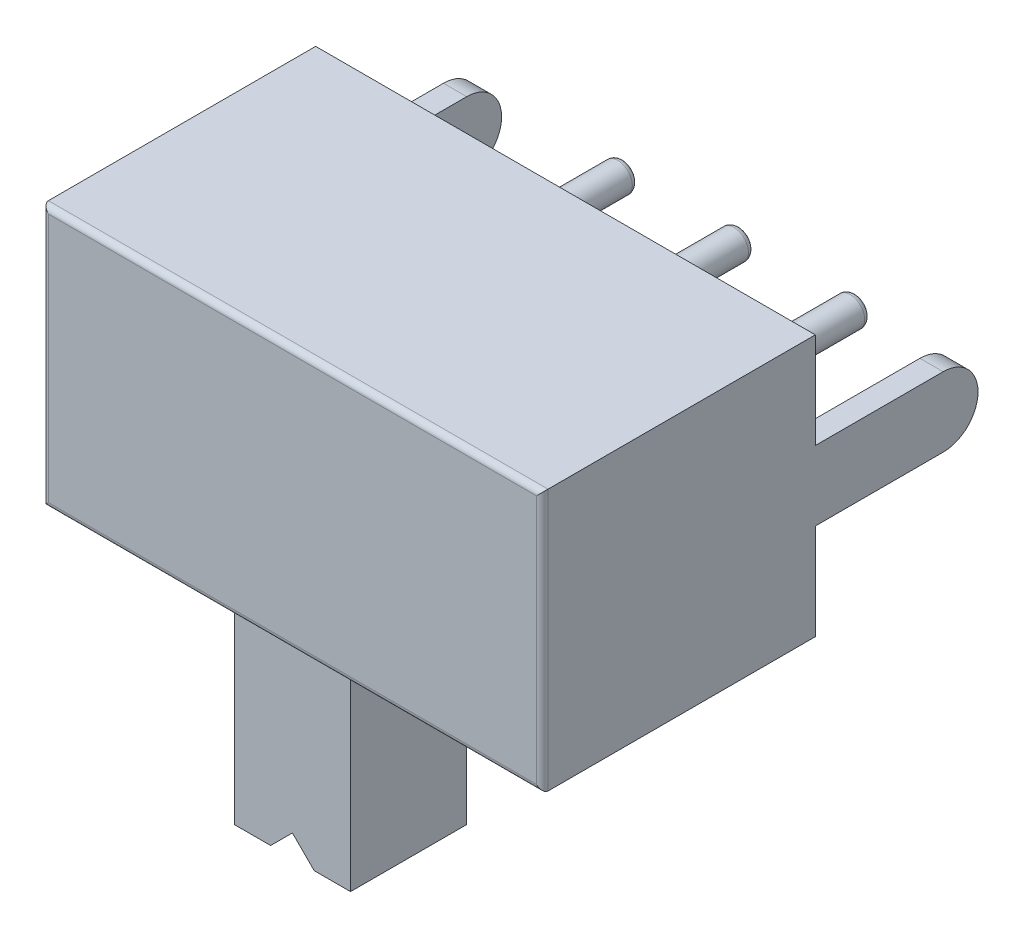
ISO-10303-21;
HEADER;
FILE_DESCRIPTION(('STEP AP214'),'2;1');
FILE_NAME('part.step','',(''),(''),'','','');
FILE_SCHEMA(('AUTOMOTIVE_DESIGN { 1 0 10303 214 1 1 1 1 }'));
ENDSEC;
DATA;
#1=APPLICATION_CONTEXT('core data for automotive mechanical design processes');
#2=APPLICATION_PROTOCOL_DEFINITION('international standard','automotive_design',2000,#1);
#3=PRODUCT_CONTEXT('',#1,'mechanical');
#4=PRODUCT('Part','Part','',(#3));
#5=PRODUCT_RELATED_PRODUCT_CATEGORY('part','',(#4));
#6=PRODUCT_DEFINITION_FORMATION('','',#4);
#7=PRODUCT_DEFINITION_CONTEXT('part definition',#1,'design');
#8=PRODUCT_DEFINITION('design','',#6,#7);
#9=PRODUCT_DEFINITION_SHAPE('','',#8);
#10=(LENGTH_UNIT() NAMED_UNIT(*) SI_UNIT(.MILLI.,.METRE.));
#11=(NAMED_UNIT(*) PLANE_ANGLE_UNIT() SI_UNIT($,.RADIAN.));
#12=(NAMED_UNIT(*) SI_UNIT($,.STERADIAN.) SOLID_ANGLE_UNIT());
#13=UNCERTAINTY_MEASURE_WITH_UNIT(LENGTH_MEASURE(1.E-05),#10,'distance_accuracy_value','');
#14=(GEOMETRIC_REPRESENTATION_CONTEXT(3) GLOBAL_UNCERTAINTY_ASSIGNED_CONTEXT((#13)) GLOBAL_UNIT_ASSIGNED_CONTEXT((#10,
#11,#12)) REPRESENTATION_CONTEXT('',''));
#15=CARTESIAN_POINT('',(0.,0.,0.));
#16=DIRECTION('',(0.,0.,1.));
#17=DIRECTION('',(1.,0.,0.));
#18=AXIS2_PLACEMENT_3D('',#15,#16,#17);
#19=CARTESIAN_POINT('',(0.,-6.35,1.7));
#20=DIRECTION('',(0.,0.,1.));
#21=DIRECTION('',(1.,0.,0.));
#22=AXIS2_PLACEMENT_3D('',#19,#20,#21);
#23=PLANE('',#22);
#24=DIRECTION('',(-0.707106781186546,0.707106781186549,0.));
#25=VECTOR('',#24,1.);
#26=CARTESIAN_POINT('',(-3.4875,-3.48749999999999,1.7));
#27=LINE('',#26,#25);
#28=CARTESIAN_POINT('',(-0.625,-6.35,1.7));
#29=VERTEX_POINT('',#28);
#30=CARTESIAN_POINT('',(-1.,-5.975,1.7));
#31=VERTEX_POINT('',#30);
#32=EDGE_CURVE('E214',#29,#31,#27,.T.);
#33=ORIENTED_EDGE('',*,*,#32,.T.);
#34=DIRECTION('',(-0.707106781186548,-0.707106781186547,0.));
#35=VECTOR('',#34,1.);
#36=CARTESIAN_POINT('',(2.4875,-2.48750000000001,1.7));
#37=LINE('',#36,#35);
#38=CARTESIAN_POINT('',(-1.375,-6.35,1.7));
#39=VERTEX_POINT('',#38);
#40=EDGE_CURVE('E235',#31,#39,#37,.T.);
#41=ORIENTED_EDGE('',*,*,#40,.T.);
#42=DIRECTION('',(1.,0.,0.));
#43=VECTOR('',#42,1.);
#44=CARTESIAN_POINT('',(0.,-6.35,1.7));
#45=LINE('',#44,#43);
#46=CARTESIAN_POINT('',(-2.,-6.35,1.7));
#47=VERTEX_POINT('',#46);
#48=EDGE_CURVE('E243',#47,#39,#45,.T.);
#49=ORIENTED_EDGE('',*,*,#48,.F.);
#50=DIRECTION('',(0.,1.,0.));
#51=VECTOR('',#50,1.);
#52=CARTESIAN_POINT('',(-2.,-6.35,1.7));
#53=LINE('',#52,#51);
#54=CARTESIAN_POINT('',(-2.,-1.75,1.7));
#55=VERTEX_POINT('',#54);
#56=EDGE_CURVE('E268',#47,#55,#53,.T.);
#57=ORIENTED_EDGE('',*,*,#56,.T.);
#58=DIRECTION('',(1.,0.,0.));
#59=VECTOR('',#58,1.);
#60=CARTESIAN_POINT('',(0.,-1.75,1.7));
#61=LINE('',#60,#59);
#62=CARTESIAN_POINT('',(0.,-1.75,1.7));
#63=VERTEX_POINT('',#62);
#64=EDGE_CURVE('E269',#55,#63,#61,.T.);
#65=ORIENTED_EDGE('',*,*,#64,.T.);
#66=DIRECTION('',(0.,1.,0.));
#67=VECTOR('',#66,1.);
#68=CARTESIAN_POINT('',(0.,-6.35,1.7));
#69=LINE('',#68,#67);
#70=CARTESIAN_POINT('',(0.,-6.35,1.7));
#71=VERTEX_POINT('',#70);
#72=EDGE_CURVE('E241',#71,#63,#69,.T.);
#73=ORIENTED_EDGE('',*,*,#72,.F.);
#74=EDGE_CURVE('E231',#29,#71,#45,.T.);
#75=ORIENTED_EDGE('',*,*,#74,.F.);
#76=EDGE_LOOP('',(#33,#41,#49,#57,#65,#73,#75));
#77=FACE_BOUND('',#76,.T.);
#78=ADVANCED_FACE('F43',(#77),#23,.F.);
#79=CARTESIAN_POINT('',(0.,-6.35,3.7));
#80=DIRECTION('',(0.,0.,1.));
#81=DIRECTION('',(1.,0.,0.));
#82=AXIS2_PLACEMENT_3D('',#79,#80,#81);
#83=PLANE('',#82);
#84=DIRECTION('',(0.707106781186548,0.707106781186547,0.));
#85=VECTOR('',#84,1.);
#86=CARTESIAN_POINT('',(2.4875,-2.48750000000001,3.7));
#87=LINE('',#86,#85);
#88=CARTESIAN_POINT('',(-1.375,-6.35,3.7));
#89=VERTEX_POINT('',#88);
#90=CARTESIAN_POINT('',(-1.,-5.975,3.7));
#91=VERTEX_POINT('',#90);
#92=EDGE_CURVE('E702',#89,#91,#87,.T.);
#93=ORIENTED_EDGE('',*,*,#92,.T.);
#94=DIRECTION('',(0.707106781186546,-0.707106781186549,0.));
#95=VECTOR('',#94,1.);
#96=CARTESIAN_POINT('',(-3.4875,-3.48749999999999,3.7));
#97=LINE('',#96,#95);
#98=CARTESIAN_POINT('',(-0.625,-6.35,3.7));
#99=VERTEX_POINT('',#98);
#100=EDGE_CURVE('E225',#91,#99,#97,.T.);
#101=ORIENTED_EDGE('',*,*,#100,.T.);
#102=DIRECTION('',(1.,0.,0.));
#103=VECTOR('',#102,1.);
#104=CARTESIAN_POINT('',(0.,-6.35,3.7));
#105=LINE('',#104,#103);
#106=CARTESIAN_POINT('',(0.,-6.35,3.7));
#107=VERTEX_POINT('',#106);
#108=EDGE_CURVE('E233',#99,#107,#105,.T.);
#109=ORIENTED_EDGE('',*,*,#108,.T.);
#110=DIRECTION('',(0.,1.,0.));
#111=VECTOR('',#110,1.);
#112=CARTESIAN_POINT('',(0.,-6.35,3.7));
#113=LINE('',#112,#111);
#114=CARTESIAN_POINT('',(0.,-1.75,3.7));
#115=VERTEX_POINT('',#114);
#116=EDGE_CURVE('E285',#107,#115,#113,.T.);
#117=ORIENTED_EDGE('',*,*,#116,.T.);
#118=DIRECTION('',(1.,0.,0.));
#119=VECTOR('',#118,1.);
#120=CARTESIAN_POINT('',(0.,-1.75,3.7));
#121=LINE('',#120,#119);
#122=CARTESIAN_POINT('',(-2.,-1.75,3.7));
#123=VERTEX_POINT('',#122);
#124=EDGE_CURVE('E253',#123,#115,#121,.T.);
#125=ORIENTED_EDGE('',*,*,#124,.F.);
#126=DIRECTION('',(0.,1.,0.));
#127=VECTOR('',#126,1.);
#128=CARTESIAN_POINT('',(-2.,-6.35,3.7));
#129=LINE('',#128,#127);
#130=CARTESIAN_POINT('',(-2.,-6.35,3.7));
#131=VERTEX_POINT('',#130);
#132=EDGE_CURVE('E281',#131,#123,#129,.T.);
#133=ORIENTED_EDGE('',*,*,#132,.F.);
#134=EDGE_CURVE('E260',#131,#89,#105,.T.);
#135=ORIENTED_EDGE('',*,*,#134,.T.);
#136=EDGE_LOOP('',(#93,#101,#109,#117,#125,#133,#135));
#137=FACE_BOUND('',#136,.T.);
#138=ADVANCED_FACE('F554',(#137),#83,.T.);
#139=CARTESIAN_POINT('',(0.,-6.35,0.));
#140=DIRECTION('',(0.,-1.,0.));
#141=DIRECTION('',(0.,0.,-1.));
#142=AXIS2_PLACEMENT_3D('',#139,#140,#141);
#143=PLANE('',#142);
#144=ORIENTED_EDGE('',*,*,#108,.F.);
#145=DIRECTION('',(0.,0.,1.));
#146=VECTOR('',#145,1.);
#147=CARTESIAN_POINT('',(-0.625,-6.35,-3.001));
#148=LINE('',#147,#146);
#149=EDGE_CURVE('E218',#29,#99,#148,.T.);
#150=ORIENTED_EDGE('',*,*,#149,.F.);
#151=ORIENTED_EDGE('',*,*,#74,.T.);
#152=DIRECTION('',(0.,0.,1.));
#153=VECTOR('',#152,1.);
#154=CARTESIAN_POINT('',(0.,-6.35,0.));
#155=LINE('',#154,#153);
#156=EDGE_CURVE('E251',#71,#107,#155,.T.);
#157=ORIENTED_EDGE('',*,*,#156,.T.);
#158=EDGE_LOOP('',(#144,#150,#151,#157));
#159=FACE_BOUND('',#158,.T.);
#160=ADVANCED_FACE('F229',(#159),#143,.T.);
#161=ORIENTED_EDGE('',*,*,#48,.T.);
#162=DIRECTION('',(0.,0.,1.));
#163=VECTOR('',#162,1.);
#164=CARTESIAN_POINT('',(-1.375,-6.35,-3.001));
#165=LINE('',#164,#163);
#166=EDGE_CURVE('E236',#39,#89,#165,.T.);
#167=ORIENTED_EDGE('',*,*,#166,.T.);
#168=ORIENTED_EDGE('',*,*,#134,.F.);
#169=DIRECTION('',(0.,0.,1.));
#170=VECTOR('',#169,1.);
#171=CARTESIAN_POINT('',(-2.,-6.35,0.));
#172=LINE('',#171,#170);
#173=EDGE_CURVE('E264',#47,#131,#172,.T.);
#174=ORIENTED_EDGE('',*,*,#173,.F.);
#175=EDGE_LOOP('',(#161,#167,#168,#174));
#176=FACE_BOUND('',#175,.T.);
#177=ADVANCED_FACE('F625',(#176),#143,.T.);
#178=CARTESIAN_POINT('',(0.,-1.75,0.));
#179=DIRECTION('',(0.,-1.,0.));
#180=DIRECTION('',(0.,0.,-1.));
#181=AXIS2_PLACEMENT_3D('',#178,#179,#180);
#182=PLANE('',#181);
#183=DIRECTION('',(0.,0.,-1.));
#184=VECTOR('',#183,1.);
#185=CARTESIAN_POINT('',(-2.05,-1.75,1.45));
#186=LINE('',#185,#184);
#187=CARTESIAN_POINT('',(-2.05,-1.75,3.95));
#188=VERTEX_POINT('',#187);
#189=CARTESIAN_POINT('',(-2.05,-1.75,1.45));
#190=VERTEX_POINT('',#189);
#191=EDGE_CURVE('E372',#188,#190,#186,.T.);
#192=ORIENTED_EDGE('',*,*,#191,.T.);
#193=DIRECTION('',(1.,0.,0.));
#194=VECTOR('',#193,1.);
#195=CARTESIAN_POINT('',(2.05,-1.75,1.45));
#196=LINE('',#195,#194);
#197=CARTESIAN_POINT('',(2.05,-1.75,1.45));
#198=VERTEX_POINT('',#197);
#199=EDGE_CURVE('E376',#190,#198,#196,.T.);
#200=ORIENTED_EDGE('',*,*,#199,.T.);
#201=DIRECTION('',(0.,0.,1.));
#202=VECTOR('',#201,1.);
#203=CARTESIAN_POINT('',(2.05,-1.75,1.45));
#204=LINE('',#203,#202);
#205=CARTESIAN_POINT('',(2.05,-1.75,3.95));
#206=VERTEX_POINT('',#205);
#207=EDGE_CURVE('E381',#198,#206,#204,.T.);
#208=ORIENTED_EDGE('',*,*,#207,.T.);
#209=DIRECTION('',(-1.,0.,0.));
#210=VECTOR('',#209,1.);
#211=CARTESIAN_POINT('',(2.05,-1.75,3.95));
#212=LINE('',#211,#210);
#213=EDGE_CURVE('E385',#206,#188,#212,.T.);
#214=ORIENTED_EDGE('',*,*,#213,.T.);
#215=EDGE_LOOP('',(#192,#200,#208,#214));
#216=FACE_BOUND('',#215,.T.);
#217=DIRECTION('',(0.,0.,1.));
#218=VECTOR('',#217,1.);
#219=CARTESIAN_POINT('',(0.,-1.75,0.));
#220=LINE('',#219,#218);
#221=EDGE_CURVE('E272',#63,#115,#220,.T.);
#222=ORIENTED_EDGE('',*,*,#221,.F.);
#223=ORIENTED_EDGE('',*,*,#64,.F.);
#224=DIRECTION('',(0.,0.,1.));
#225=VECTOR('',#224,1.);
#226=CARTESIAN_POINT('',(-2.,-1.75,0.));
#227=LINE('',#226,#225);
#228=EDGE_CURVE('E244',#55,#123,#227,.T.);
#229=ORIENTED_EDGE('',*,*,#228,.T.);
#230=ORIENTED_EDGE('',*,*,#124,.T.);
#231=EDGE_LOOP('',(#222,#223,#229,#230));
#232=FACE_BOUND('',#231,.T.);
#233=ADVANCED_FACE('F621',(#216,#232),#182,.T.);
#234=CARTESIAN_POINT('',(0.,0.,0.));
#235=DIRECTION('',(0.,0.,1.));
#236=DIRECTION('',(1.,0.,0.));
#237=AXIS2_PLACEMENT_3D('',#234,#235,#236);
#238=PLANE('',#237);
#239=CARTESIAN_POINT('',(2.,0.,0.));
#240=DIRECTION('',(0.,0.,1.));
#241=DIRECTION('',(1.,0.,0.));
#242=AXIS2_PLACEMENT_3D('',#239,#240,#241);
#243=CIRCLE('',#242,0.25);
#244=CARTESIAN_POINT('',(2.25,0.,0.));
#245=VERTEX_POINT('',#244);
#246=EDGE_CURVE('E452',#245,#245,#243,.F.);
#247=ORIENTED_EDGE('',*,*,#246,.F.);
#248=EDGE_LOOP('',(#247));
#249=FACE_BOUND('',#248,.T.);
#250=CARTESIAN_POINT('',(0.,0.,0.));
#251=DIRECTION('',(0.,0.,1.));
#252=DIRECTION('',(1.,0.,0.));
#253=AXIS2_PLACEMENT_3D('',#250,#251,#252);
#254=CIRCLE('',#253,0.25);
#255=CARTESIAN_POINT('',(0.25,0.,0.));
#256=VERTEX_POINT('',#255);
#257=EDGE_CURVE('E448',#256,#256,#254,.F.);
#258=ORIENTED_EDGE('',*,*,#257,.F.);
#259=EDGE_LOOP('',(#258));
#260=FACE_BOUND('',#259,.T.);
#261=CARTESIAN_POINT('',(-2.,0.,0.));
#262=DIRECTION('',(0.,0.,1.));
#263=DIRECTION('',(1.,0.,0.));
#264=AXIS2_PLACEMENT_3D('',#261,#262,#263);
#265=CIRCLE('',#264,0.25);
#266=CARTESIAN_POINT('',(-1.75,0.,0.));
#267=VERTEX_POINT('',#266);
#268=EDGE_CURVE('E444',#267,#267,#265,.F.);
#269=ORIENTED_EDGE('',*,*,#268,.F.);
#270=EDGE_LOOP('',(#269));
#271=FACE_BOUND('',#270,.T.);
#272=DIRECTION('',(-1.,0.,0.));
#273=VECTOR('',#272,1.);
#274=CARTESIAN_POINT('',(-3.9,-0.6,0.));
#275=LINE('',#274,#273);
#276=CARTESIAN_POINT('',(-3.9,-0.6,0.));
#277=VERTEX_POINT('',#276);
#278=CARTESIAN_POINT('',(-4.3,-0.6,0.));
#279=VERTEX_POINT('',#278);
#280=EDGE_CURVE('E308',#277,#279,#275,.T.);
#281=ORIENTED_EDGE('',*,*,#280,.F.);
#282=DIRECTION('',(0.,1.,0.));
#283=VECTOR('',#282,1.);
#284=CARTESIAN_POINT('',(-3.9,0.,0.));
#285=LINE('',#284,#283);
#286=CARTESIAN_POINT('',(-3.9,0.6,0.));
#287=VERTEX_POINT('',#286);
#288=EDGE_CURVE('E296',#277,#287,#285,.T.);
#289=ORIENTED_EDGE('',*,*,#288,.T.);
#290=DIRECTION('',(-1.,0.,0.));
#291=VECTOR('',#290,1.);
#292=CARTESIAN_POINT('',(-3.9,0.6,0.));
#293=LINE('',#292,#291);
#294=CARTESIAN_POINT('',(-4.3,0.6,0.));
#295=VERTEX_POINT('',#294);
#296=EDGE_CURVE('E326',#287,#295,#293,.T.);
#297=ORIENTED_EDGE('',*,*,#296,.T.);
#298=DIRECTION('',(0.,-1.,0.));
#299=VECTOR('',#298,1.);
#300=CARTESIAN_POINT('',(-4.3,-2.25,0.));
#301=LINE('',#300,#299);
#302=CARTESIAN_POINT('',(-4.3,2.25,0.));
#303=VERTEX_POINT('',#302);
#304=EDGE_CURVE('E415',#303,#295,#301,.T.);
#305=ORIENTED_EDGE('',*,*,#304,.F.);
#306=DIRECTION('',(-1.,0.,0.));
#307=VECTOR('',#306,1.);
#308=CARTESIAN_POINT('',(4.3,2.25,0.));
#309=LINE('',#308,#307);
#310=CARTESIAN_POINT('',(4.3,2.25,0.));
#311=VERTEX_POINT('',#310);
#312=EDGE_CURVE('E428',#311,#303,#309,.T.);
#313=ORIENTED_EDGE('',*,*,#312,.F.);
#314=DIRECTION('',(0.,1.,0.));
#315=VECTOR('',#314,1.);
#316=CARTESIAN_POINT('',(4.3,-2.25,0.));
#317=LINE('',#316,#315);
#318=CARTESIAN_POINT('',(4.3,0.6,0.));
#319=VERTEX_POINT('',#318);
#320=EDGE_CURVE('E423',#319,#311,#317,.T.);
#321=ORIENTED_EDGE('',*,*,#320,.F.);
#322=DIRECTION('',(1.,0.,0.));
#323=VECTOR('',#322,1.);
#324=CARTESIAN_POINT('',(3.9,0.6,0.));
#325=LINE('',#324,#323);
#326=CARTESIAN_POINT('',(3.9,0.6,0.));
#327=VERTEX_POINT('',#326);
#328=EDGE_CURVE('E364',#327,#319,#325,.T.);
#329=ORIENTED_EDGE('',*,*,#328,.F.);
#330=DIRECTION('',(0.,1.,0.));
#331=VECTOR('',#330,1.);
#332=CARTESIAN_POINT('',(3.9,0.,0.));
#333=LINE('',#332,#331);
#334=CARTESIAN_POINT('',(3.9,-0.6,0.));
#335=VERTEX_POINT('',#334);
#336=EDGE_CURVE('E345',#335,#327,#333,.T.);
#337=ORIENTED_EDGE('',*,*,#336,.F.);
#338=DIRECTION('',(1.,0.,0.));
#339=VECTOR('',#338,1.);
#340=CARTESIAN_POINT('',(3.9,-0.6,0.));
#341=LINE('',#340,#339);
#342=CARTESIAN_POINT('',(4.3,-0.6,0.));
#343=VERTEX_POINT('',#342);
#344=EDGE_CURVE('E359',#335,#343,#341,.T.);
#345=ORIENTED_EDGE('',*,*,#344,.T.);
#346=CARTESIAN_POINT('',(4.3,-2.25,0.));
#347=VERTEX_POINT('',#346);
#348=EDGE_CURVE('E424',#347,#343,#317,.T.);
#349=ORIENTED_EDGE('',*,*,#348,.F.);
#350=DIRECTION('',(1.,0.,0.));
#351=VECTOR('',#350,1.);
#352=CARTESIAN_POINT('',(4.3,-2.25,0.));
#353=LINE('',#352,#351);
#354=CARTESIAN_POINT('',(-4.3,-2.25,0.));
#355=VERTEX_POINT('',#354);
#356=EDGE_CURVE('E419',#355,#347,#353,.T.);
#357=ORIENTED_EDGE('',*,*,#356,.F.);
#358=EDGE_CURVE('E405',#279,#355,#301,.T.);
#359=ORIENTED_EDGE('',*,*,#358,.F.);
#360=EDGE_LOOP('',(#281,#289,#297,#305,#313,#321,#329,#337,#345,#349,#357,#359));
#361=FACE_BOUND('',#360,.T.);
#362=ADVANCED_FACE('F624',(#249,#260,#271,#361),#238,.F.);
#363=CARTESIAN_POINT('',(-4.3,-2.25,4.7));
#364=DIRECTION('',(1.,0.,0.));
#365=DIRECTION('',(0.,0.,-1.));
#366=AXIS2_PLACEMENT_3D('',#363,#364,#365);
#367=PLANE('',#366);
#368=DIRECTION('',(0.,0.,-1.));
#369=VECTOR('',#368,1.);
#370=CARTESIAN_POINT('',(-4.3,-2.25,4.7));
#371=LINE('',#370,#369);
#372=CARTESIAN_POINT('',(-4.3,-2.25,4.6));
#373=VERTEX_POINT('',#372);
#374=EDGE_CURVE('E441',#373,#355,#371,.T.);
#375=ORIENTED_EDGE('',*,*,#374,.F.);
#376=DIRECTION('',(0.,-1.,0.));
#377=VECTOR('',#376,1.);
#378=CARTESIAN_POINT('',(-4.3,2.25,4.6));
#379=LINE('',#378,#377);
#380=CARTESIAN_POINT('',(-4.3,2.25,4.6));
#381=VERTEX_POINT('',#380);
#382=EDGE_CURVE('E469',#373,#381,#379,.F.);
#383=ORIENTED_EDGE('',*,*,#382,.T.);
#384=DIRECTION('',(0.,0.,-1.));
#385=VECTOR('',#384,1.);
#386=CARTESIAN_POINT('',(-4.3,2.25,4.7));
#387=LINE('',#386,#385);
#388=EDGE_CURVE('E432',#381,#303,#387,.T.);
#389=ORIENTED_EDGE('',*,*,#388,.T.);
#390=ORIENTED_EDGE('',*,*,#304,.T.);
#391=DIRECTION('',(0.,0.,-1.));
#392=VECTOR('',#391,1.);
#393=CARTESIAN_POINT('',(-4.3,0.6,0.));
#394=LINE('',#393,#392);
#395=CARTESIAN_POINT('',(-4.3,0.600000000000001,-2.2));
#396=VERTEX_POINT('',#395);
#397=EDGE_CURVE('E312',#295,#396,#394,.T.);
#398=ORIENTED_EDGE('',*,*,#397,.T.);
#399=CARTESIAN_POINT('',(-4.3,0.,-2.2));
#400=DIRECTION('',(1.,0.,0.));
#401=DIRECTION('',(0.,0.,-1.));
#402=AXIS2_PLACEMENT_3D('',#399,#400,#401);
#403=CIRCLE('',#402,0.6);
#404=CARTESIAN_POINT('',(-4.3,-0.6,-2.2));
#405=VERTEX_POINT('',#404);
#406=EDGE_CURVE('E297',#405,#396,#403,.T.);
#407=ORIENTED_EDGE('',*,*,#406,.F.);
#408=DIRECTION('',(0.,0.,-1.));
#409=VECTOR('',#408,1.);
#410=CARTESIAN_POINT('',(-4.3,-0.6,0.));
#411=LINE('',#410,#409);
#412=EDGE_CURVE('E291',#279,#405,#411,.T.);
#413=ORIENTED_EDGE('',*,*,#412,.F.);
#414=ORIENTED_EDGE('',*,*,#358,.T.);
#415=EDGE_LOOP('',(#375,#383,#389,#390,#398,#407,#413,#414));
#416=FACE_BOUND('',#415,.T.);
#417=ADVANCED_FACE('F531',(#416),#367,.F.);
#418=CARTESIAN_POINT('',(4.3,-2.25,4.7));
#419=DIRECTION('',(0.,1.,0.));
#420=DIRECTION('',(-1.,0.,0.));
#421=AXIS2_PLACEMENT_3D('',#418,#419,#420);
#422=PLANE('',#421);
#423=DIRECTION('',(1.,0.,0.));
#424=VECTOR('',#423,1.);
#425=CARTESIAN_POINT('',(2.05,-2.25,1.45));
#426=LINE('',#425,#424);
#427=CARTESIAN_POINT('',(-2.05,-2.25,1.45));
#428=VERTEX_POINT('',#427);
#429=CARTESIAN_POINT('',(2.05,-2.25,1.45));
#430=VERTEX_POINT('',#429);
#431=EDGE_CURVE('E391',#428,#430,#426,.T.);
#432=ORIENTED_EDGE('',*,*,#431,.F.);
#433=DIRECTION('',(0.,0.,-1.));
#434=VECTOR('',#433,1.);
#435=CARTESIAN_POINT('',(-2.05,-2.25,1.45));
#436=LINE('',#435,#434);
#437=CARTESIAN_POINT('',(-2.05,-2.25,3.95));
#438=VERTEX_POINT('',#437);
#439=EDGE_CURVE('E363',#438,#428,#436,.T.);
#440=ORIENTED_EDGE('',*,*,#439,.F.);
#441=DIRECTION('',(-1.,0.,0.));
#442=VECTOR('',#441,1.);
#443=CARTESIAN_POINT('',(2.05,-2.25,3.95));
#444=LINE('',#443,#442);
#445=CARTESIAN_POINT('',(2.05,-2.25,3.95));
#446=VERTEX_POINT('',#445);
#447=EDGE_CURVE('E377',#446,#438,#444,.T.);
#448=ORIENTED_EDGE('',*,*,#447,.F.);
#449=DIRECTION('',(0.,0.,1.));
#450=VECTOR('',#449,1.);
#451=CARTESIAN_POINT('',(2.05,-2.25,1.45));
#452=LINE('',#451,#450);
#453=EDGE_CURVE('E395',#430,#446,#452,.T.);
#454=ORIENTED_EDGE('',*,*,#453,.F.);
#455=EDGE_LOOP('',(#432,#440,#448,#454));
#456=FACE_BOUND('',#455,.T.);
#457=DIRECTION('',(0.,0.,-1.));
#458=VECTOR('',#457,1.);
#459=CARTESIAN_POINT('',(4.3,-2.25,4.7));
#460=LINE('',#459,#458);
#461=CARTESIAN_POINT('',(4.3,-2.25,4.6));
#462=VERTEX_POINT('',#461);
#463=EDGE_CURVE('E438',#462,#347,#460,.T.);
#464=ORIENTED_EDGE('',*,*,#463,.F.);
#465=DIRECTION('',(1.,0.,0.));
#466=VECTOR('',#465,1.);
#467=CARTESIAN_POINT('',(-4.3,-2.25,4.6));
#468=LINE('',#467,#466);
#469=EDGE_CURVE('E477',#462,#373,#468,.F.);
#470=ORIENTED_EDGE('',*,*,#469,.T.);
#471=ORIENTED_EDGE('',*,*,#374,.T.);
#472=ORIENTED_EDGE('',*,*,#356,.T.);
#473=EDGE_LOOP('',(#464,#470,#471,#472));
#474=FACE_BOUND('',#473,.T.);
#475=ADVANCED_FACE('F527',(#456,#474),#422,.F.);
#476=CARTESIAN_POINT('',(4.3,-2.25,4.7));
#477=DIRECTION('',(-1.,0.,0.));
#478=DIRECTION('',(0.,0.,1.));
#479=AXIS2_PLACEMENT_3D('',#476,#477,#478);
#480=PLANE('',#479);
#481=DIRECTION('',(0.,0.,-1.));
#482=VECTOR('',#481,1.);
#483=CARTESIAN_POINT('',(4.3,2.25,4.7));
#484=LINE('',#483,#482);
#485=CARTESIAN_POINT('',(4.3,2.25,4.6));
#486=VERTEX_POINT('',#485);
#487=EDGE_CURVE('E435',#486,#311,#484,.T.);
#488=ORIENTED_EDGE('',*,*,#487,.F.);
#489=DIRECTION('',(0.,1.,0.));
#490=VECTOR('',#489,1.);
#491=CARTESIAN_POINT('',(4.3,-2.25,4.6));
#492=LINE('',#491,#490);
#493=EDGE_CURVE('E61',#486,#462,#492,.F.);
#494=ORIENTED_EDGE('',*,*,#493,.T.);
#495=ORIENTED_EDGE('',*,*,#463,.T.);
#496=ORIENTED_EDGE('',*,*,#348,.T.);
#497=DIRECTION('',(0.,0.,-1.));
#498=VECTOR('',#497,1.);
#499=CARTESIAN_POINT('',(4.3,-0.6,0.));
#500=LINE('',#499,#498);
#501=CARTESIAN_POINT('',(4.3,-0.6,-2.2));
#502=VERTEX_POINT('',#501);
#503=EDGE_CURVE('E322',#343,#502,#500,.T.);
#504=ORIENTED_EDGE('',*,*,#503,.T.);
#505=CARTESIAN_POINT('',(4.3,0.,-2.2));
#506=DIRECTION('',(1.,0.,0.));
#507=DIRECTION('',(0.,0.,-1.));
#508=AXIS2_PLACEMENT_3D('',#505,#506,#507);
#509=CIRCLE('',#508,0.6);
#510=CARTESIAN_POINT('',(4.3,0.600000000000001,-2.2));
#511=VERTEX_POINT('',#510);
#512=EDGE_CURVE('E352',#502,#511,#509,.T.);
#513=ORIENTED_EDGE('',*,*,#512,.T.);
#514=DIRECTION('',(0.,0.,-1.));
#515=VECTOR('',#514,1.);
#516=CARTESIAN_POINT('',(4.3,0.6,0.));
#517=LINE('',#516,#515);
#518=EDGE_CURVE('E338',#319,#511,#517,.T.);
#519=ORIENTED_EDGE('',*,*,#518,.F.);
#520=ORIENTED_EDGE('',*,*,#320,.T.);
#521=EDGE_LOOP('',(#488,#494,#495,#496,#504,#513,#519,#520));
#522=FACE_BOUND('',#521,.T.);
#523=ADVANCED_FACE('F550',(#522),#480,.F.);
#524=CARTESIAN_POINT('',(4.3,2.25,4.7));
#525=DIRECTION('',(0.,-1.,0.));
#526=DIRECTION('',(1.,0.,0.));
#527=AXIS2_PLACEMENT_3D('',#524,#525,#526);
#528=PLANE('',#527);
#529=ORIENTED_EDGE('',*,*,#388,.F.);
#530=DIRECTION('',(-1.,0.,0.));
#531=VECTOR('',#530,1.);
#532=CARTESIAN_POINT('',(4.3,2.25,4.6));
#533=LINE('',#532,#531);
#534=EDGE_CURVE('E69',#381,#486,#533,.F.);
#535=ORIENTED_EDGE('',*,*,#534,.T.);
#536=ORIENTED_EDGE('',*,*,#487,.T.);
#537=ORIENTED_EDGE('',*,*,#312,.T.);
#538=EDGE_LOOP('',(#529,#535,#536,#537));
#539=FACE_BOUND('',#538,.T.);
#540=ADVANCED_FACE('F541',(#539),#528,.F.);
#541=CARTESIAN_POINT('',(0.,0.,4.7));
#542=DIRECTION('',(0.,0.,1.));
#543=DIRECTION('',(1.,0.,0.));
#544=AXIS2_PLACEMENT_3D('',#541,#542,#543);
#545=PLANE('',#544);
#546=DIRECTION('',(-1.,0.,0.));
#547=VECTOR('',#546,1.);
#548=CARTESIAN_POINT('',(-4.3,2.15,4.7));
#549=LINE('',#548,#547);
#550=CARTESIAN_POINT('',(4.2,2.15,4.7));
#551=VERTEX_POINT('',#550);
#552=CARTESIAN_POINT('',(-4.2,2.15,4.7));
#553=VERTEX_POINT('',#552);
#554=EDGE_CURVE('E462',#551,#553,#549,.T.);
#555=ORIENTED_EDGE('',*,*,#554,.T.);
#556=DIRECTION('',(0.,-1.,0.));
#557=VECTOR('',#556,1.);
#558=CARTESIAN_POINT('',(-4.2,-2.25,4.7));
#559=LINE('',#558,#557);
#560=CARTESIAN_POINT('',(-4.2,-2.15,4.7));
#561=VERTEX_POINT('',#560);
#562=EDGE_CURVE('E465',#553,#561,#559,.T.);
#563=ORIENTED_EDGE('',*,*,#562,.T.);
#564=DIRECTION('',(1.,0.,0.));
#565=VECTOR('',#564,1.);
#566=CARTESIAN_POINT('',(4.3,-2.15,4.7));
#567=LINE('',#566,#565);
#568=CARTESIAN_POINT('',(4.2,-2.15,4.7));
#569=VERTEX_POINT('',#568);
#570=EDGE_CURVE('E456',#561,#569,#567,.T.);
#571=ORIENTED_EDGE('',*,*,#570,.T.);
#572=DIRECTION('',(0.,1.,0.));
#573=VECTOR('',#572,1.);
#574=CARTESIAN_POINT('',(4.2,2.25,4.7));
#575=LINE('',#574,#573);
#576=EDGE_CURVE('E459',#569,#551,#575,.T.);
#577=ORIENTED_EDGE('',*,*,#576,.T.);
#578=EDGE_LOOP('',(#555,#563,#571,#577));
#579=FACE_BOUND('',#578,.T.);
#580=ADVANCED_FACE('F538',(#579),#545,.T.);
#581=CARTESIAN_POINT('',(-2.05,-1.75,1.45));
#582=DIRECTION('',(-1.,0.,0.));
#583=DIRECTION('',(0.,-1.,0.));
#584=AXIS2_PLACEMENT_3D('',#581,#582,#583);
#585=PLANE('',#584);
#586=ORIENTED_EDGE('',*,*,#439,.T.);
#587=DIRECTION('',(0.,-1.,0.));
#588=VECTOR('',#587,1.);
#589=CARTESIAN_POINT('',(-2.05,-1.75,1.45));
#590=LINE('',#589,#588);
#591=EDGE_CURVE('E388',#190,#428,#590,.T.);
#592=ORIENTED_EDGE('',*,*,#591,.F.);
#593=ORIENTED_EDGE('',*,*,#191,.F.);
#594=DIRECTION('',(0.,-1.,0.));
#595=VECTOR('',#594,1.);
#596=CARTESIAN_POINT('',(-2.05,-1.75,3.95));
#597=LINE('',#596,#595);
#598=EDGE_CURVE('E402',#188,#438,#597,.T.);
#599=ORIENTED_EDGE('',*,*,#598,.T.);
#600=EDGE_LOOP('',(#586,#592,#593,#599));
#601=FACE_BOUND('',#600,.T.);
#602=ADVANCED_FACE('F540',(#601),#585,.F.);
#603=CARTESIAN_POINT('',(2.05,-1.75,3.95));
#604=DIRECTION('',(0.,0.,1.));
#605=DIRECTION('',(1.,0.,0.));
#606=AXIS2_PLACEMENT_3D('',#603,#604,#605);
#607=PLANE('',#606);
#608=ORIENTED_EDGE('',*,*,#447,.T.);
#609=ORIENTED_EDGE('',*,*,#598,.F.);
#610=ORIENTED_EDGE('',*,*,#213,.F.);
#611=DIRECTION('',(0.,-1.,0.));
#612=VECTOR('',#611,1.);
#613=CARTESIAN_POINT('',(2.05,-1.75,3.95));
#614=LINE('',#613,#612);
#615=EDGE_CURVE('E406',#206,#446,#614,.T.);
#616=ORIENTED_EDGE('',*,*,#615,.T.);
#617=EDGE_LOOP('',(#608,#609,#610,#616));
#618=FACE_BOUND('',#617,.T.);
#619=ADVANCED_FACE('F547',(#618),#607,.F.);
#620=CARTESIAN_POINT('',(2.05,-1.75,1.45));
#621=DIRECTION('',(1.,0.,0.));
#622=DIRECTION('',(0.,1.,0.));
#623=AXIS2_PLACEMENT_3D('',#620,#621,#622);
#624=PLANE('',#623);
#625=ORIENTED_EDGE('',*,*,#453,.T.);
#626=ORIENTED_EDGE('',*,*,#615,.F.);
#627=ORIENTED_EDGE('',*,*,#207,.F.);
#628=DIRECTION('',(0.,-1.,0.));
#629=VECTOR('',#628,1.);
#630=CARTESIAN_POINT('',(2.05,-1.75,1.45));
#631=LINE('',#630,#629);
#632=EDGE_CURVE('E409',#198,#430,#631,.T.);
#633=ORIENTED_EDGE('',*,*,#632,.T.);
#634=EDGE_LOOP('',(#625,#626,#627,#633));
#635=FACE_BOUND('',#634,.T.);
#636=ADVANCED_FACE('F629',(#635),#624,.F.);
#637=CARTESIAN_POINT('',(2.05,-1.75,1.45));
#638=DIRECTION('',(0.,0.,-1.));
#639=DIRECTION('',(-1.,0.,0.));
#640=AXIS2_PLACEMENT_3D('',#637,#638,#639);
#641=PLANE('',#640);
#642=ORIENTED_EDGE('',*,*,#431,.T.);
#643=ORIENTED_EDGE('',*,*,#632,.F.);
#644=ORIENTED_EDGE('',*,*,#199,.F.);
#645=ORIENTED_EDGE('',*,*,#591,.T.);
#646=EDGE_LOOP('',(#642,#643,#644,#645));
#647=FACE_BOUND('',#646,.T.);
#648=ADVANCED_FACE('F619',(#647),#641,.F.);
#649=CARTESIAN_POINT('',(3.9,-0.6,0.));
#650=DIRECTION('',(0.,-1.,0.));
#651=DIRECTION('',(0.,0.,-1.));
#652=AXIS2_PLACEMENT_3D('',#649,#650,#651);
#653=PLANE('',#652);
#654=ORIENTED_EDGE('',*,*,#503,.F.);
#655=ORIENTED_EDGE('',*,*,#344,.F.);
#656=DIRECTION('',(0.,0.,-1.));
#657=VECTOR('',#656,1.);
#658=CARTESIAN_POINT('',(3.9,-0.6,0.));
#659=LINE('',#658,#657);
#660=CARTESIAN_POINT('',(3.9,-0.6,-2.2));
#661=VERTEX_POINT('',#660);
#662=EDGE_CURVE('E333',#335,#661,#659,.T.);
#663=ORIENTED_EDGE('',*,*,#662,.T.);
#664=DIRECTION('',(1.,0.,0.));
#665=VECTOR('',#664,1.);
#666=CARTESIAN_POINT('',(3.9,-0.6,-2.2));
#667=LINE('',#666,#665);
#668=EDGE_CURVE('E348',#661,#502,#667,.T.);
#669=ORIENTED_EDGE('',*,*,#668,.T.);
#670=EDGE_LOOP('',(#654,#655,#663,#669));
#671=FACE_BOUND('',#670,.T.);
#672=ADVANCED_FACE('F612',(#671),#653,.T.);
#673=CARTESIAN_POINT('',(3.9,0.6,0.));
#674=DIRECTION('',(0.,-1.,0.));
#675=DIRECTION('',(0.,0.,-1.));
#676=AXIS2_PLACEMENT_3D('',#673,#674,#675);
#677=PLANE('',#676);
#678=ORIENTED_EDGE('',*,*,#518,.T.);
#679=DIRECTION('',(1.,0.,0.));
#680=VECTOR('',#679,1.);
#681=CARTESIAN_POINT('',(3.9,0.600000000000001,-2.2));
#682=LINE('',#681,#680);
#683=CARTESIAN_POINT('',(3.9,0.600000000000001,-2.2));
#684=VERTEX_POINT('',#683);
#685=EDGE_CURVE('E367',#684,#511,#682,.T.);
#686=ORIENTED_EDGE('',*,*,#685,.F.);
#687=DIRECTION('',(0.,0.,-1.));
#688=VECTOR('',#687,1.);
#689=CARTESIAN_POINT('',(3.9,0.6,0.));
#690=LINE('',#689,#688);
#691=EDGE_CURVE('E342',#327,#684,#690,.T.);
#692=ORIENTED_EDGE('',*,*,#691,.F.);
#693=ORIENTED_EDGE('',*,*,#328,.T.);
#694=EDGE_LOOP('',(#678,#686,#692,#693));
#695=FACE_BOUND('',#694,.T.);
#696=ADVANCED_FACE('F609',(#695),#677,.F.);
#697=CARTESIAN_POINT('',(3.9,0.,-2.2));
#698=DIRECTION('',(1.,0.,0.));
#699=DIRECTION('',(0.,0.,-1.));
#700=AXIS2_PLACEMENT_3D('',#697,#698,#699);
#701=CYLINDRICAL_SURFACE('',#700,0.6);
#702=ORIENTED_EDGE('',*,*,#512,.F.);
#703=ORIENTED_EDGE('',*,*,#668,.F.);
#704=CARTESIAN_POINT('',(3.9,0.,-2.2));
#705=DIRECTION('',(1.,0.,0.));
#706=DIRECTION('',(0.,0.,-1.));
#707=AXIS2_PLACEMENT_3D('',#704,#705,#706);
#708=CIRCLE('',#707,0.6);
#709=EDGE_CURVE('E337',#661,#684,#708,.T.);
#710=ORIENTED_EDGE('',*,*,#709,.T.);
#711=ORIENTED_EDGE('',*,*,#685,.T.);
#712=EDGE_LOOP('',(#702,#703,#710,#711));
#713=FACE_BOUND('',#712,.T.);
#714=ADVANCED_FACE('F607',(#713),#701,.T.);
#715=CARTESIAN_POINT('',(3.9,0.,0.));
#716=DIRECTION('',(1.,0.,0.));
#717=DIRECTION('',(0.,0.,-1.));
#718=AXIS2_PLACEMENT_3D('',#715,#716,#717);
#719=PLANE('',#718);
#720=ORIENTED_EDGE('',*,*,#662,.F.);
#721=ORIENTED_EDGE('',*,*,#336,.T.);
#722=ORIENTED_EDGE('',*,*,#691,.T.);
#723=ORIENTED_EDGE('',*,*,#709,.F.);
#724=EDGE_LOOP('',(#720,#721,#722,#723));
#725=FACE_BOUND('',#724,.T.);
#726=ADVANCED_FACE('F603',(#725),#719,.F.);
#727=CARTESIAN_POINT('',(-3.9,-0.6,0.));
#728=DIRECTION('',(0.,1.,0.));
#729=DIRECTION('',(0.,0.,1.));
#730=AXIS2_PLACEMENT_3D('',#727,#728,#729);
#731=PLANE('',#730);
#732=ORIENTED_EDGE('',*,*,#412,.T.);
#733=DIRECTION('',(-1.,0.,0.));
#734=VECTOR('',#733,1.);
#735=CARTESIAN_POINT('',(-3.9,-0.6,-2.2));
#736=LINE('',#735,#734);
#737=CARTESIAN_POINT('',(-3.9,-0.6,-2.2));
#738=VERTEX_POINT('',#737);
#739=EDGE_CURVE('E319',#738,#405,#736,.T.);
#740=ORIENTED_EDGE('',*,*,#739,.F.);
#741=DIRECTION('',(0.,0.,-1.));
#742=VECTOR('',#741,1.);
#743=CARTESIAN_POINT('',(-3.9,-0.6,0.));
#744=LINE('',#743,#742);
#745=EDGE_CURVE('E292',#277,#738,#744,.T.);
#746=ORIENTED_EDGE('',*,*,#745,.F.);
#747=ORIENTED_EDGE('',*,*,#280,.T.);
#748=EDGE_LOOP('',(#732,#740,#746,#747));
#749=FACE_BOUND('',#748,.T.);
#750=ADVANCED_FACE('F596',(#749),#731,.F.);
#751=CARTESIAN_POINT('',(-3.9,0.,-2.2));
#752=DIRECTION('',(-1.,0.,0.));
#753=DIRECTION('',(0.,0.,1.));
#754=AXIS2_PLACEMENT_3D('',#751,#752,#753);
#755=CYLINDRICAL_SURFACE('',#754,0.6);
#756=ORIENTED_EDGE('',*,*,#406,.T.);
#757=DIRECTION('',(-1.,0.,0.));
#758=VECTOR('',#757,1.);
#759=CARTESIAN_POINT('',(-3.9,0.600000000000001,-2.2));
#760=LINE('',#759,#758);
#761=CARTESIAN_POINT('',(-3.9,0.600000000000001,-2.2));
#762=VERTEX_POINT('',#761);
#763=EDGE_CURVE('E323',#762,#396,#760,.T.);
#764=ORIENTED_EDGE('',*,*,#763,.F.);
#765=CARTESIAN_POINT('',(-3.9,0.,-2.2));
#766=DIRECTION('',(1.,0.,0.));
#767=DIRECTION('',(0.,0.,-1.));
#768=AXIS2_PLACEMENT_3D('',#765,#766,#767);
#769=CIRCLE('',#768,0.6);
#770=EDGE_CURVE('E305',#738,#762,#769,.T.);
#771=ORIENTED_EDGE('',*,*,#770,.F.);
#772=ORIENTED_EDGE('',*,*,#739,.T.);
#773=EDGE_LOOP('',(#756,#764,#771,#772));
#774=FACE_BOUND('',#773,.T.);
#775=ADVANCED_FACE('F593',(#774),#755,.T.);
#776=CARTESIAN_POINT('',(-3.9,0.6,0.));
#777=DIRECTION('',(0.,1.,0.));
#778=DIRECTION('',(0.,0.,1.));
#779=AXIS2_PLACEMENT_3D('',#776,#777,#778);
#780=PLANE('',#779);
#781=ORIENTED_EDGE('',*,*,#397,.F.);
#782=ORIENTED_EDGE('',*,*,#296,.F.);
#783=DIRECTION('',(0.,0.,-1.));
#784=VECTOR('',#783,1.);
#785=CARTESIAN_POINT('',(-3.9,0.6,0.));
#786=LINE('',#785,#784);
#787=EDGE_CURVE('E301',#287,#762,#786,.T.);
#788=ORIENTED_EDGE('',*,*,#787,.T.);
#789=ORIENTED_EDGE('',*,*,#763,.T.);
#790=EDGE_LOOP('',(#781,#782,#788,#789));
#791=FACE_BOUND('',#790,.T.);
#792=ADVANCED_FACE('F591',(#791),#780,.T.);
#793=CARTESIAN_POINT('',(-3.9,0.,0.));
#794=DIRECTION('',(-1.,0.,0.));
#795=DIRECTION('',(0.,0.,-1.));
#796=AXIS2_PLACEMENT_3D('',#793,#794,#795);
#797=PLANE('',#796);
#798=ORIENTED_EDGE('',*,*,#745,.T.);
#799=ORIENTED_EDGE('',*,*,#770,.T.);
#800=ORIENTED_EDGE('',*,*,#787,.F.);
#801=ORIENTED_EDGE('',*,*,#288,.F.);
#802=EDGE_LOOP('',(#798,#799,#800,#801));
#803=FACE_BOUND('',#802,.T.);
#804=ADVANCED_FACE('F587',(#803),#797,.F.);
#805=CARTESIAN_POINT('',(-2.,0.,-3.));
#806=DIRECTION('',(0.,0.,1.));
#807=DIRECTION('',(1.,0.,0.));
#808=AXIS2_PLACEMENT_3D('',#805,#806,#807);
#809=CYLINDRICAL_SURFACE('',#808,0.25);
#810=CARTESIAN_POINT('',(-2.,0.,-2.9));
#811=DIRECTION('',(0.,0.,-1.));
#812=DIRECTION('',(-1.,0.,0.));
#813=AXIS2_PLACEMENT_3D('',#810,#811,#812);
#814=CIRCLE('',#813,0.25);
#815=CARTESIAN_POINT('',(-2.25,0.,-2.9));
#816=VERTEX_POINT('',#815);
#817=EDGE_CURVE('E484',#816,#816,#814,.F.);
#818=ORIENTED_EDGE('',*,*,#817,.T.);
#819=EDGE_LOOP('',(#818));
#820=FACE_BOUND('',#819,.T.);
#821=ORIENTED_EDGE('',*,*,#268,.T.);
#822=EDGE_LOOP('',(#821));
#823=FACE_BOUND('',#822,.T.);
#824=ADVANCED_FACE('F583',(#820,#823),#809,.T.);
#825=CARTESIAN_POINT('',(0.,0.,-3.));
#826=DIRECTION('',(0.,0.,-1.));
#827=DIRECTION('',(-1.,0.,0.));
#828=AXIS2_PLACEMENT_3D('',#825,#826,#827);
#829=PLANE('',#828);
#830=CARTESIAN_POINT('',(-2.,0.,-3.));
#831=DIRECTION('',(0.,0.,-1.));
#832=DIRECTION('',(-1.,0.,0.));
#833=AXIS2_PLACEMENT_3D('',#830,#831,#832);
#834=CIRCLE('',#833,0.15);
#835=CARTESIAN_POINT('',(-2.15,0.,-3.));
#836=VERTEX_POINT('',#835);
#837=EDGE_CURVE('E480',#836,#836,#834,.T.);
#838=ORIENTED_EDGE('',*,*,#837,.T.);
#839=EDGE_LOOP('',(#838));
#840=FACE_BOUND('',#839,.T.);
#841=ADVANCED_FACE('F579',(#840),#829,.T.);
#842=CARTESIAN_POINT('',(0.,0.,-3.));
#843=DIRECTION('',(0.,0.,1.));
#844=DIRECTION('',(1.,0.,0.));
#845=AXIS2_PLACEMENT_3D('',#842,#843,#844);
#846=CYLINDRICAL_SURFACE('',#845,0.25);
#847=CARTESIAN_POINT('',(0.,0.,-2.9));
#848=DIRECTION('',(0.,0.,-1.));
#849=DIRECTION('',(-1.,0.,0.));
#850=AXIS2_PLACEMENT_3D('',#847,#848,#849);
#851=CIRCLE('',#850,0.25);
#852=CARTESIAN_POINT('',(-0.25,0.,-2.9));
#853=VERTEX_POINT('',#852);
#854=EDGE_CURVE('E492',#853,#853,#851,.F.);
#855=ORIENTED_EDGE('',*,*,#854,.T.);
#856=EDGE_LOOP('',(#855));
#857=FACE_BOUND('',#856,.T.);
#858=ORIENTED_EDGE('',*,*,#257,.T.);
#859=EDGE_LOOP('',(#858));
#860=FACE_BOUND('',#859,.T.);
#861=ADVANCED_FACE('F575',(#857,#860),#846,.T.);
#862=CARTESIAN_POINT('',(0.,0.,-3.));
#863=DIRECTION('',(0.,0.,-1.));
#864=DIRECTION('',(-1.,0.,0.));
#865=AXIS2_PLACEMENT_3D('',#862,#863,#864);
#866=PLANE('',#865);
#867=CARTESIAN_POINT('',(0.,0.,-3.));
#868=DIRECTION('',(0.,0.,-1.));
#869=DIRECTION('',(-1.,0.,0.));
#870=AXIS2_PLACEMENT_3D('',#867,#868,#869);
#871=CIRCLE('',#870,0.15);
#872=CARTESIAN_POINT('',(-0.15,0.,-3.));
#873=VERTEX_POINT('',#872);
#874=EDGE_CURVE('E488',#873,#873,#871,.T.);
#875=ORIENTED_EDGE('',*,*,#874,.T.);
#876=EDGE_LOOP('',(#875));
#877=FACE_BOUND('',#876,.T.);
#878=ADVANCED_FACE('F571',(#877),#866,.T.);
#879=CARTESIAN_POINT('',(2.,0.,-3.));
#880=DIRECTION('',(0.,0.,1.));
#881=DIRECTION('',(1.,0.,0.));
#882=AXIS2_PLACEMENT_3D('',#879,#880,#881);
#883=CYLINDRICAL_SURFACE('',#882,0.25);
#884=CARTESIAN_POINT('',(2.,0.,-2.9));
#885=DIRECTION('',(0.,0.,-1.));
#886=DIRECTION('',(-1.,0.,0.));
#887=AXIS2_PLACEMENT_3D('',#884,#885,#886);
#888=CIRCLE('',#887,0.25);
#889=CARTESIAN_POINT('',(1.75,0.,-2.9));
#890=VERTEX_POINT('',#889);
#891=EDGE_CURVE('E11',#890,#890,#888,.F.);
#892=ORIENTED_EDGE('',*,*,#891,.T.);
#893=EDGE_LOOP('',(#892));
#894=FACE_BOUND('',#893,.T.);
#895=ORIENTED_EDGE('',*,*,#246,.T.);
#896=EDGE_LOOP('',(#895));
#897=FACE_BOUND('',#896,.T.);
#898=ADVANCED_FACE('F567',(#894,#897),#883,.T.);
#899=CARTESIAN_POINT('',(0.,0.,-3.));
#900=DIRECTION('',(0.,0.,-1.));
#901=DIRECTION('',(-1.,0.,0.));
#902=AXIS2_PLACEMENT_3D('',#899,#900,#901);
#903=PLANE('',#902);
#904=CARTESIAN_POINT('',(2.,0.,-3.));
#905=DIRECTION('',(0.,0.,-1.));
#906=DIRECTION('',(-1.,0.,0.));
#907=AXIS2_PLACEMENT_3D('',#904,#905,#906);
#908=CIRCLE('',#907,0.15);
#909=CARTESIAN_POINT('',(1.85,0.,-3.));
#910=VERTEX_POINT('',#909);
#911=EDGE_CURVE('E53',#910,#910,#908,.T.);
#912=ORIENTED_EDGE('',*,*,#911,.T.);
#913=EDGE_LOOP('',(#912));
#914=FACE_BOUND('',#913,.T.);
#915=ADVANCED_FACE('F564',(#914),#903,.T.);
#916=CARTESIAN_POINT('',(0.,-6.35,0.));
#917=DIRECTION('',(-1.,0.,0.));
#918=DIRECTION('',(0.,0.,1.));
#919=AXIS2_PLACEMENT_3D('',#916,#917,#918);
#920=PLANE('',#919);
#921=ORIENTED_EDGE('',*,*,#221,.T.);
#922=ORIENTED_EDGE('',*,*,#116,.F.);
#923=ORIENTED_EDGE('',*,*,#156,.F.);
#924=ORIENTED_EDGE('',*,*,#72,.T.);
#925=EDGE_LOOP('',(#921,#922,#923,#924));
#926=FACE_BOUND('',#925,.T.);
#927=ADVANCED_FACE('F563',(#926),#920,.F.);
#928=CARTESIAN_POINT('',(-2.,-6.35,0.));
#929=DIRECTION('',(-1.,0.,0.));
#930=DIRECTION('',(0.,0.,1.));
#931=AXIS2_PLACEMENT_3D('',#928,#929,#930);
#932=PLANE('',#931);
#933=ORIENTED_EDGE('',*,*,#228,.F.);
#934=ORIENTED_EDGE('',*,*,#56,.F.);
#935=ORIENTED_EDGE('',*,*,#173,.T.);
#936=ORIENTED_EDGE('',*,*,#132,.T.);
#937=EDGE_LOOP('',(#933,#934,#935,#936));
#938=FACE_BOUND('',#937,.T.);
#939=ADVANCED_FACE('F655',(#938),#932,.T.);
#940=CARTESIAN_POINT('',(-3.4875,-3.48749999999999,-3.001));
#941=DIRECTION('',(-0.707106781186549,-0.707106781186546,0.));
#942=DIRECTION('',(0.707106781186546,-0.707106781186549,0.));
#943=AXIS2_PLACEMENT_3D('',#940,#941,#942);
#944=PLANE('',#943);
#945=ORIENTED_EDGE('',*,*,#149,.T.);
#946=ORIENTED_EDGE('',*,*,#100,.F.);
#947=DIRECTION('',(0.,0.,1.));
#948=VECTOR('',#947,1.);
#949=CARTESIAN_POINT('',(-1.,-5.975,-3.001));
#950=LINE('',#949,#948);
#951=EDGE_CURVE('E220',#31,#91,#950,.T.);
#952=ORIENTED_EDGE('',*,*,#951,.F.);
#953=ORIENTED_EDGE('',*,*,#32,.F.);
#954=EDGE_LOOP('',(#945,#946,#952,#953));
#955=FACE_BOUND('',#954,.T.);
#956=ADVANCED_FACE('F216',(#955),#944,.T.);
#957=CARTESIAN_POINT('',(2.4875,-2.48750000000001,-3.001));
#958=DIRECTION('',(0.707106781186547,-0.707106781186548,0.));
#959=DIRECTION('',(0.707106781186548,0.707106781186547,0.));
#960=AXIS2_PLACEMENT_3D('',#957,#958,#959);
#961=PLANE('',#960);
#962=ORIENTED_EDGE('',*,*,#951,.T.);
#963=ORIENTED_EDGE('',*,*,#92,.F.);
#964=ORIENTED_EDGE('',*,*,#166,.F.);
#965=ORIENTED_EDGE('',*,*,#40,.F.);
#966=EDGE_LOOP('',(#962,#963,#964,#965));
#967=FACE_BOUND('',#966,.T.);
#968=ADVANCED_FACE('F754',(#967),#961,.T.);
#969=CARTESIAN_POINT('',(4.2,0.,4.6));
#970=DIRECTION('',(0.,-1.,0.));
#971=DIRECTION('',(0.,0.,-1.));
#972=AXIS2_PLACEMENT_3D('',#969,#970,#971);
#973=CYLINDRICAL_SURFACE('',#972,0.1);
#974=CARTESIAN_POINT('',(4.2,-2.15,4.6));
#975=DIRECTION('',(-0.707106781186547,-0.707106781186547,0.));
#976=DIRECTION('',(-0.707106781186548,0.707106781186547,0.));
#977=AXIS2_PLACEMENT_3D('',#974,#975,#976);
#978=ELLIPSE('',#977,0.14142135623731,0.1);
#979=EDGE_CURVE('E504',#462,#569,#978,.T.);
#980=ORIENTED_EDGE('',*,*,#979,.F.);
#981=ORIENTED_EDGE('',*,*,#493,.F.);
#982=CARTESIAN_POINT('',(4.2,2.15,4.6));
#983=DIRECTION('',(0.707106781186548,-0.707106781186547,0.));
#984=DIRECTION('',(-0.707106781186547,-0.707106781186547,0.));
#985=AXIS2_PLACEMENT_3D('',#982,#983,#984);
#986=ELLIPSE('',#985,0.14142135623731,0.1);
#987=EDGE_CURVE('E47',#551,#486,#986,.F.);
#988=ORIENTED_EDGE('',*,*,#987,.F.);
#989=ORIENTED_EDGE('',*,*,#576,.F.);
#990=EDGE_LOOP('',(#980,#981,#988,#989));
#991=FACE_BOUND('',#990,.T.);
#992=ADVANCED_FACE('F522',(#991),#973,.T.);
#993=CARTESIAN_POINT('',(0.,2.15,4.6));
#994=DIRECTION('',(1.,0.,0.));
#995=DIRECTION('',(0.,1.,0.));
#996=AXIS2_PLACEMENT_3D('',#993,#994,#995);
#997=CYLINDRICAL_SURFACE('',#996,0.1);
#998=ORIENTED_EDGE('',*,*,#987,.T.);
#999=ORIENTED_EDGE('',*,*,#534,.F.);
#1000=CARTESIAN_POINT('',(-4.2,2.15,4.6));
#1001=DIRECTION('',(0.707106781186547,0.707106781186547,0.));
#1002=DIRECTION('',(0.707106781186548,-0.707106781186547,0.));
#1003=AXIS2_PLACEMENT_3D('',#1000,#1001,#1002);
#1004=ELLIPSE('',#1003,0.14142135623731,0.1);
#1005=EDGE_CURVE('E502',#553,#381,#1004,.F.);
#1006=ORIENTED_EDGE('',*,*,#1005,.F.);
#1007=ORIENTED_EDGE('',*,*,#554,.F.);
#1008=EDGE_LOOP('',(#998,#999,#1006,#1007));
#1009=FACE_BOUND('',#1008,.T.);
#1010=ADVANCED_FACE('F518',(#1009),#997,.T.);
#1011=CARTESIAN_POINT('',(0.,-2.15,4.6));
#1012=DIRECTION('',(-1.,0.,0.));
#1013=DIRECTION('',(0.,-1.,0.));
#1014=AXIS2_PLACEMENT_3D('',#1011,#1012,#1013);
#1015=CYLINDRICAL_SURFACE('',#1014,0.1);
#1016=ORIENTED_EDGE('',*,*,#979,.T.);
#1017=ORIENTED_EDGE('',*,*,#570,.F.);
#1018=CARTESIAN_POINT('',(-4.2,-2.15,4.6));
#1019=DIRECTION('',(-0.707106781186548,0.707106781186547,0.));
#1020=DIRECTION('',(-0.707106781186547,-0.707106781186547,0.));
#1021=AXIS2_PLACEMENT_3D('',#1018,#1019,#1020);
#1022=ELLIPSE('',#1021,0.14142135623731,0.1);
#1023=EDGE_CURVE('E499',#373,#561,#1022,.T.);
#1024=ORIENTED_EDGE('',*,*,#1023,.F.);
#1025=ORIENTED_EDGE('',*,*,#469,.F.);
#1026=EDGE_LOOP('',(#1016,#1017,#1024,#1025));
#1027=FACE_BOUND('',#1026,.T.);
#1028=ADVANCED_FACE('F524',(#1027),#1015,.T.);
#1029=CARTESIAN_POINT('',(-4.2,0.,4.6));
#1030=DIRECTION('',(0.,1.,0.));
#1031=DIRECTION('',(0.,0.,1.));
#1032=AXIS2_PLACEMENT_3D('',#1029,#1030,#1031);
#1033=CYLINDRICAL_SURFACE('',#1032,0.1);
#1034=ORIENTED_EDGE('',*,*,#1005,.T.);
#1035=ORIENTED_EDGE('',*,*,#382,.F.);
#1036=ORIENTED_EDGE('',*,*,#1023,.T.);
#1037=ORIENTED_EDGE('',*,*,#562,.F.);
#1038=EDGE_LOOP('',(#1034,#1035,#1036,#1037));
#1039=FACE_BOUND('',#1038,.T.);
#1040=ADVANCED_FACE('F535',(#1039),#1033,.T.);
#1041=CARTESIAN_POINT('',(-2.,0.,-2.9));
#1042=DIRECTION('',(0.,0.,-1.));
#1043=DIRECTION('',(-1.,0.,0.));
#1044=AXIS2_PLACEMENT_3D('',#1041,#1042,#1043);
#1045=TOROIDAL_SURFACE('',#1044,0.15,0.1);
#1046=ORIENTED_EDGE('',*,*,#817,.F.);
#1047=EDGE_LOOP('',(#1046));
#1048=FACE_BOUND('',#1047,.T.);
#1049=ORIENTED_EDGE('',*,*,#837,.F.);
#1050=EDGE_LOOP('',(#1049));
#1051=FACE_BOUND('',#1050,.T.);
#1052=ADVANCED_FACE('F949',(#1048,#1051),#1045,.T.);
#1053=CARTESIAN_POINT('',(0.,0.,-2.9));
#1054=DIRECTION('',(0.,0.,-1.));
#1055=DIRECTION('',(-1.,0.,0.));
#1056=AXIS2_PLACEMENT_3D('',#1053,#1054,#1055);
#1057=TOROIDAL_SURFACE('',#1056,0.15,0.1);
#1058=ORIENTED_EDGE('',*,*,#854,.F.);
#1059=EDGE_LOOP('',(#1058));
#1060=FACE_BOUND('',#1059,.T.);
#1061=ORIENTED_EDGE('',*,*,#874,.F.);
#1062=EDGE_LOOP('',(#1061));
#1063=FACE_BOUND('',#1062,.T.);
#1064=ADVANCED_FACE('F958',(#1060,#1063),#1057,.T.);
#1065=CARTESIAN_POINT('',(2.,0.,-2.9));
#1066=DIRECTION('',(0.,0.,-1.));
#1067=DIRECTION('',(-1.,0.,0.));
#1068=AXIS2_PLACEMENT_3D('',#1065,#1066,#1067);
#1069=TOROIDAL_SURFACE('',#1068,0.15,0.1);
#1070=ORIENTED_EDGE('',*,*,#891,.F.);
#1071=EDGE_LOOP('',(#1070));
#1072=FACE_BOUND('',#1071,.T.);
#1073=ORIENTED_EDGE('',*,*,#911,.F.);
#1074=EDGE_LOOP('',(#1073));
#1075=FACE_BOUND('',#1074,.T.);
#1076=ADVANCED_FACE('F45',(#1072,#1075),#1069,.T.);
#1077=CLOSED_SHELL('',(#78,#138,#160,#177,#233,#362,#417,#475,#523,#540,#580,#602,#619,#636,
#648,#672,#696,#714,#726,#750,#775,#792,#804,#824,#841,#861,#878,#898,#915,#927,#939,#956,#968,
#992,#1010,#1028,#1040,#1052,#1064,#1076));
#1078=MANIFOLD_SOLID_BREP('B2',#1077);
#1079=ADVANCED_BREP_SHAPE_REPRESENTATION('',(#18,#1078),#14);
#1080=SHAPE_DEFINITION_REPRESENTATION(#9,#1079);
ENDSEC;
END-ISO-10303-21;
